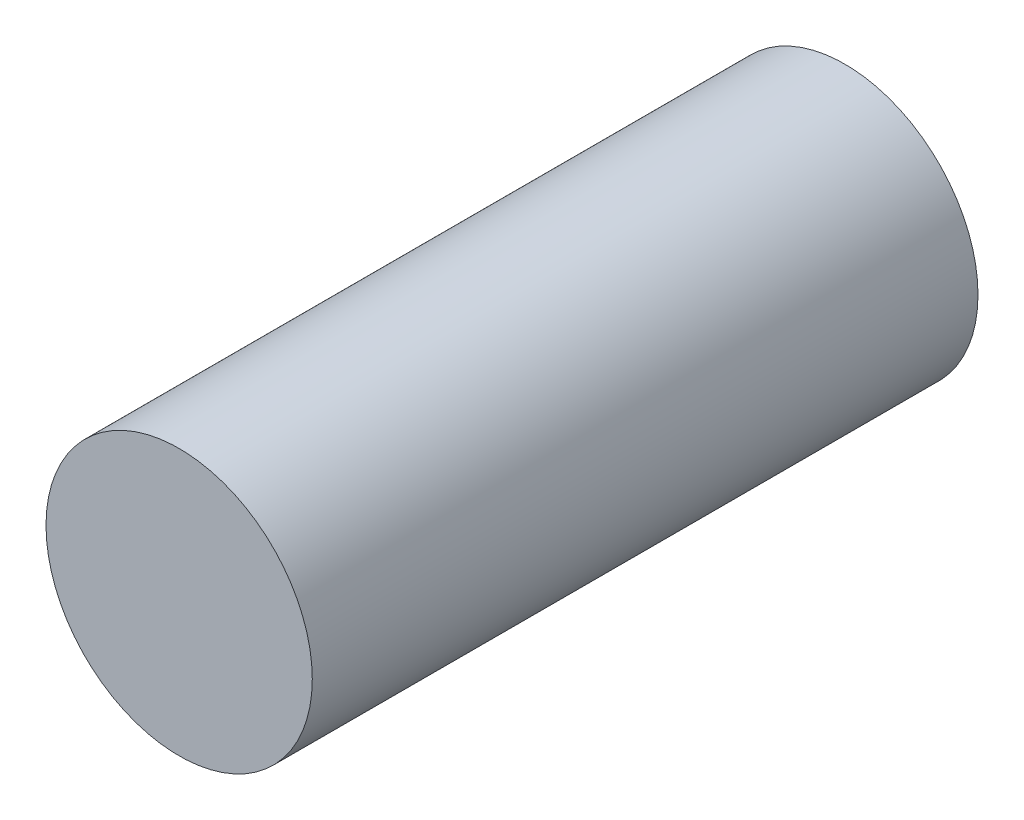
ISO-10303-21;
HEADER;
FILE_DESCRIPTION(('STEP AP214'),'2;1');
FILE_NAME('part.step','',(''),(''),'','','');
FILE_SCHEMA(('AUTOMOTIVE_DESIGN { 1 0 10303 214 1 1 1 1 }'));
ENDSEC;
DATA;
#1=APPLICATION_CONTEXT('core data for automotive mechanical design processes');
#2=APPLICATION_PROTOCOL_DEFINITION('international standard','automotive_design',2000,#1);
#3=PRODUCT_CONTEXT('',#1,'mechanical');
#4=PRODUCT('Part','Part','',(#3));
#5=PRODUCT_RELATED_PRODUCT_CATEGORY('part','',(#4));
#6=PRODUCT_DEFINITION_FORMATION('','',#4);
#7=PRODUCT_DEFINITION_CONTEXT('part definition',#1,'design');
#8=PRODUCT_DEFINITION('design','',#6,#7);
#9=PRODUCT_DEFINITION_SHAPE('','',#8);
#10=(LENGTH_UNIT() NAMED_UNIT(*) SI_UNIT(.MILLI.,.METRE.));
#11=(NAMED_UNIT(*) PLANE_ANGLE_UNIT() SI_UNIT($,.RADIAN.));
#12=(NAMED_UNIT(*) SI_UNIT($,.STERADIAN.) SOLID_ANGLE_UNIT());
#13=UNCERTAINTY_MEASURE_WITH_UNIT(LENGTH_MEASURE(1.E-05),#10,'distance_accuracy_value','');
#14=(GEOMETRIC_REPRESENTATION_CONTEXT(3) GLOBAL_UNCERTAINTY_ASSIGNED_CONTEXT((#13)) GLOBAL_UNIT_ASSIGNED_CONTEXT((#10,
#11,#12)) REPRESENTATION_CONTEXT('',''));
#15=CARTESIAN_POINT('',(0.,0.,0.));
#16=DIRECTION('',(0.,0.,1.));
#17=DIRECTION('',(1.,0.,0.));
#18=AXIS2_PLACEMENT_3D('',#15,#16,#17);
#19=CARTESIAN_POINT('',(0.,0.,25.));
#20=DIRECTION('',(0.,0.,-1.));
#21=DIRECTION('',(-1.,0.,0.));
#22=AXIS2_PLACEMENT_3D('',#19,#20,#21);
#23=CYLINDRICAL_SURFACE('',#22,5.);
#24=CARTESIAN_POINT('',(0.,0.,25.));
#25=DIRECTION('',(0.,0.,1.));
#26=DIRECTION('',(1.,0.,0.));
#27=AXIS2_PLACEMENT_3D('',#24,#25,#26);
#28=CIRCLE('',#27,5.);
#29=CARTESIAN_POINT('',(5.,0.,25.));
#30=VERTEX_POINT('',#29);
#31=EDGE_CURVE('E10',#30,#30,#28,.T.);
#32=ORIENTED_EDGE('',*,*,#31,.F.);
#33=EDGE_LOOP('',(#32));
#34=FACE_BOUND('',#33,.T.);
#35=CARTESIAN_POINT('',(0.,0.,0.));
#36=DIRECTION('',(0.,0.,1.));
#37=DIRECTION('',(1.,0.,0.));
#38=AXIS2_PLACEMENT_3D('',#35,#36,#37);
#39=CIRCLE('',#38,5.);
#40=CARTESIAN_POINT('',(5.,0.,0.));
#41=VERTEX_POINT('',#40);
#42=EDGE_CURVE('E38',#41,#41,#39,.T.);
#43=ORIENTED_EDGE('',*,*,#42,.T.);
#44=EDGE_LOOP('',(#43));
#45=FACE_BOUND('',#44,.T.);
#46=ADVANCED_FACE('F35',(#34,#45),#23,.T.);
#47=CARTESIAN_POINT('',(0.,0.,25.));
#48=DIRECTION('',(0.,0.,1.));
#49=DIRECTION('',(1.,0.,0.));
#50=AXIS2_PLACEMENT_3D('',#47,#48,#49);
#51=PLANE('',#50);
#52=ORIENTED_EDGE('',*,*,#31,.T.);
#53=EDGE_LOOP('',(#52));
#54=FACE_BOUND('',#53,.T.);
#55=ADVANCED_FACE('F50',(#54),#51,.T.);
#56=CARTESIAN_POINT('',(0.,0.,0.));
#57=DIRECTION('',(0.,0.,1.));
#58=DIRECTION('',(1.,0.,0.));
#59=AXIS2_PLACEMENT_3D('',#56,#57,#58);
#60=PLANE('',#59);
#61=ORIENTED_EDGE('',*,*,#42,.F.);
#62=EDGE_LOOP('',(#61));
#63=FACE_BOUND('',#62,.T.);
#64=ADVANCED_FACE('F48',(#63),#60,.F.);
#65=CLOSED_SHELL('',(#46,#55,#64));
#66=MANIFOLD_SOLID_BREP('B2',#65);
#67=ADVANCED_BREP_SHAPE_REPRESENTATION('',(#18,#66),#14);
#68=SHAPE_DEFINITION_REPRESENTATION(#9,#67);
ENDSEC;
END-ISO-10303-21;
